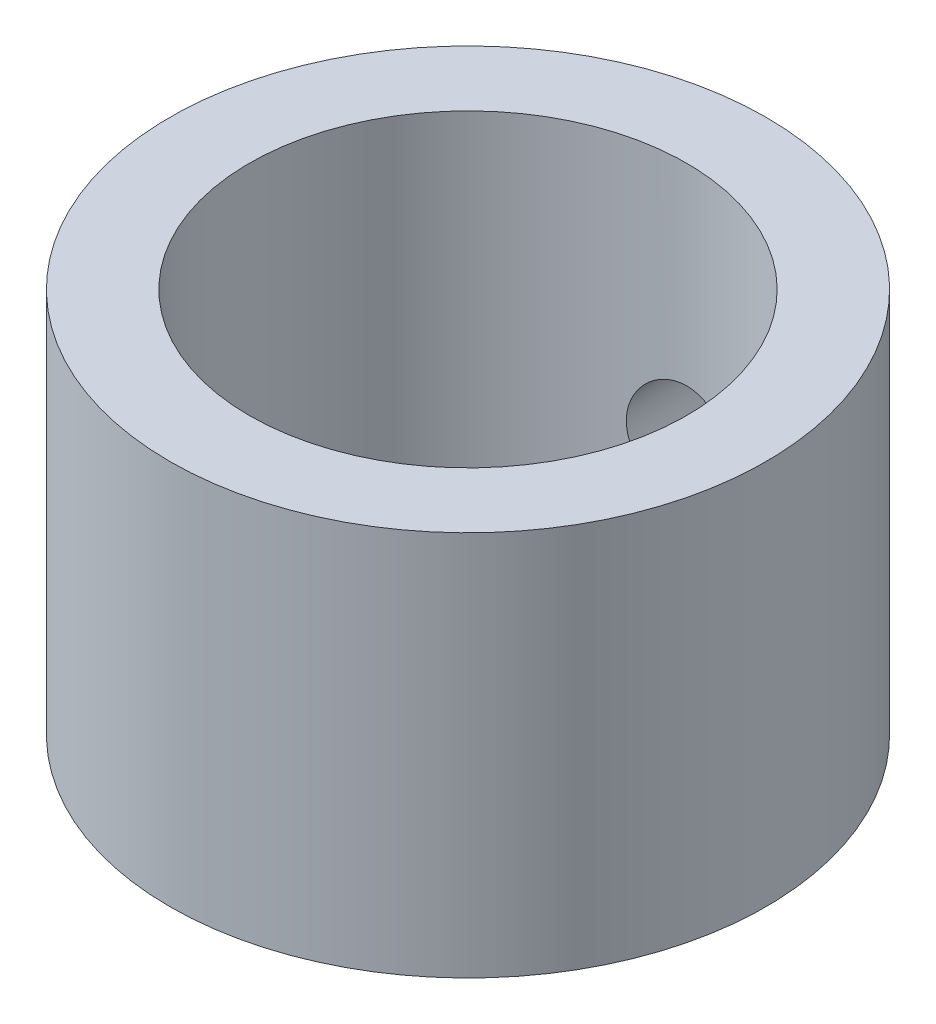
ISO-10303-21;
HEADER;
FILE_DESCRIPTION(('STEP AP214'),'2;1');
FILE_NAME('part.step','',(''),(''),'','','');
FILE_SCHEMA(('AUTOMOTIVE_DESIGN { 1 0 10303 214 1 1 1 1 }'));
ENDSEC;
DATA;
#1=APPLICATION_CONTEXT('core data for automotive mechanical design processes');
#2=APPLICATION_PROTOCOL_DEFINITION('international standard','automotive_design',2000,#1);
#3=PRODUCT_CONTEXT('',#1,'mechanical');
#4=PRODUCT('Part','Part','',(#3));
#5=PRODUCT_RELATED_PRODUCT_CATEGORY('part','',(#4));
#6=PRODUCT_DEFINITION_FORMATION('','',#4);
#7=PRODUCT_DEFINITION_CONTEXT('part definition',#1,'design');
#8=PRODUCT_DEFINITION('design','',#6,#7);
#9=PRODUCT_DEFINITION_SHAPE('','',#8);
#10=(LENGTH_UNIT() NAMED_UNIT(*) SI_UNIT(.MILLI.,.METRE.));
#11=(NAMED_UNIT(*) PLANE_ANGLE_UNIT() SI_UNIT($,.RADIAN.));
#12=(NAMED_UNIT(*) SI_UNIT($,.STERADIAN.) SOLID_ANGLE_UNIT());
#13=UNCERTAINTY_MEASURE_WITH_UNIT(LENGTH_MEASURE(1.E-05),#10,'distance_accuracy_value','');
#14=(GEOMETRIC_REPRESENTATION_CONTEXT(3) GLOBAL_UNCERTAINTY_ASSIGNED_CONTEXT((#13)) GLOBAL_UNIT_ASSIGNED_CONTEXT((#10,
#11,#12)) REPRESENTATION_CONTEXT('',''));
#15=CARTESIAN_POINT('',(0.,0.,0.));
#16=DIRECTION('',(0.,0.,1.));
#17=DIRECTION('',(1.,0.,0.));
#18=AXIS2_PLACEMENT_3D('',#15,#16,#17);
#19=CARTESIAN_POINT('',(0.,0.,0.));
#20=DIRECTION('',(0.,1.,0.));
#21=DIRECTION('',(0.,0.,1.));
#22=AXIS2_PLACEMENT_3D('',#19,#20,#21);
#23=PLANE('',#22);
#24=CARTESIAN_POINT('',(0.,0.,0.));
#25=DIRECTION('',(0.,1.,0.));
#26=DIRECTION('',(0.,0.,1.));
#27=AXIS2_PLACEMENT_3D('',#24,#25,#26);
#28=CIRCLE('',#27,9.525);
#29=CARTESIAN_POINT('',(0.,0.,9.525));
#30=VERTEX_POINT('',#29);
#31=EDGE_CURVE('E10',#30,#30,#28,.T.);
#32=ORIENTED_EDGE('',*,*,#31,.F.);
#33=EDGE_LOOP('',(#32));
#34=FACE_BOUND('',#33,.T.);
#35=CARTESIAN_POINT('',(0.,0.,0.));
#36=DIRECTION('',(0.,1.,0.));
#37=DIRECTION('',(0.,0.,1.));
#38=AXIS2_PLACEMENT_3D('',#35,#36,#37);
#39=CIRCLE('',#38,6.985);
#40=CARTESIAN_POINT('',(0.,0.,6.985));
#41=VERTEX_POINT('',#40);
#42=EDGE_CURVE('E45',#41,#41,#39,.T.);
#43=ORIENTED_EDGE('',*,*,#42,.T.);
#44=EDGE_LOOP('',(#43));
#45=FACE_BOUND('',#44,.T.);
#46=ADVANCED_FACE('F31',(#34,#45),#23,.F.);
#47=CARTESIAN_POINT('',(0.,4.445,0.));
#48=DIRECTION('',(0.,-1.,0.));
#49=DIRECTION('',(0.,0.,-1.));
#50=AXIS2_PLACEMENT_3D('',#47,#48,#49);
#51=CYLINDRICAL_SURFACE('',#50,9.525);
#52=CARTESIAN_POINT('',(0.,6.1595,-9.525));
#53=CARTESIAN_POINT('',(-0.0954775956739414,6.1594962806579,-9.52499829882828));
#54=CARTESIAN_POINT('',(-0.191004397105449,6.15149757329919,-9.52354954239769));
#55=CARTESIAN_POINT('',(-0.37937082774304,6.11973195521184,-9.51790975414186));
#56=CARTESIAN_POINT('',(-0.472208039467171,6.09595129168973,-9.51371633058855));
#57=CARTESIAN_POINT('',(-0.652443448537809,6.03336963114219,-9.50305676664695));
#58=CARTESIAN_POINT('',(-0.739846309455742,5.99458172522165,-9.49659260751604));
#59=CARTESIAN_POINT('',(-0.906894366746162,5.90312273914429,-9.48209926373113));
#60=CARTESIAN_POINT('',(-0.986540286093455,5.85045295452756,-9.47407022513926));
#61=CARTESIAN_POINT('',(-1.13670505743633,5.73210551094706,-9.45723532780296));
#62=CARTESIAN_POINT('',(-1.20712553851598,5.66630400502557,-9.44842255353012));
#63=CARTESIAN_POINT('',(-1.3359899130627,5.52382746948852,-9.43106535815257));
#64=CARTESIAN_POINT('',(-1.39443298649654,5.44715169597391,-9.42252095545581));
#65=CARTESIAN_POINT('',(-1.49808719556154,5.28441515371638,-9.40660083197784));
#66=CARTESIAN_POINT('',(-1.5431992972205,5.19829035610144,-9.39923403605664));
#67=CARTESIAN_POINT('',(-1.61827727569674,5.01952999289207,-9.38660014534282));
#68=CARTESIAN_POINT('',(-1.64824435203196,4.92689494358547,-9.38133288426961));
#69=CARTESIAN_POINT('',(-1.69186804071753,4.73879267575865,-9.37356378709239));
#70=CARTESIAN_POINT('',(-1.70569558394198,4.64336631803518,-9.37103299110417));
#71=CARTESIAN_POINT('',(-1.71717803678369,4.45151700678056,-9.36893595775777));
#72=CARTESIAN_POINT('',(-1.71483428193499,4.35509413620481,-9.36936947558667));
#73=CARTESIAN_POINT('',(-1.69417950443828,4.16522043348779,-9.37312569257245));
#74=CARTESIAN_POINT('',(-1.67606196586981,4.07174775946657,-9.37641338056608));
#75=CARTESIAN_POINT('',(-1.62467822208323,3.88919077231936,-9.38545257746093));
#76=CARTESIAN_POINT('',(-1.59141141912748,3.80010663250348,-9.3912041835793));
#77=CARTESIAN_POINT('',(-1.51048167179206,3.62828448094136,-9.40456021184459));
#78=CARTESIAN_POINT('',(-1.4627397764373,3.54558447453583,-9.41217474978867));
#79=CARTESIAN_POINT('',(-1.35427097721947,3.38929624160546,-9.42839186635934));
#80=CARTESIAN_POINT('',(-1.29354285575569,3.31570887051217,-9.4369945375992));
#81=CARTESIAN_POINT('',(-1.15977815742905,3.17861609368458,-9.45437165554872));
#82=CARTESIAN_POINT('',(-1.08657589217406,3.11527232951862,-9.46314678440982));
#83=CARTESIAN_POINT('',(-0.93049748072582,3.00174083164846,-9.47976521483666));
#84=CARTESIAN_POINT('',(-0.847621251422725,2.95155321098182,-9.48760850839575));
#85=CARTESIAN_POINT('',(-0.674385063879582,2.86573824695064,-9.50149354422627));
#86=CARTESIAN_POINT('',(-0.584017079081404,2.83012676915752,-9.5075333215165));
#87=CARTESIAN_POINT('',(-0.398449230816276,2.77463336892464,-9.51711542565165));
#88=CARTESIAN_POINT('',(-0.303249840771157,2.75474990847581,-9.52065799668932));
#89=CARTESIAN_POINT('',(-0.112113142672695,2.73149975931381,-9.52481325849361));
#90=CARTESIAN_POINT('',(-0.0162036201946852,2.72791144011981,-9.52546526100933));
#91=CARTESIAN_POINT('',(0.174845366618844,2.73676028417332,-9.52387417101183));
#92=CARTESIAN_POINT('',(0.269984865514023,2.74919672415024,-9.52163120916156));
#93=CARTESIAN_POINT('',(0.456097023765723,2.78955775590117,-9.51452663429934));
#94=CARTESIAN_POINT('',(0.547094588542276,2.81737110394692,-9.50968383691693));
#95=CARTESIAN_POINT('',(0.723135169873516,2.88757672049449,-9.49792033518775));
#96=CARTESIAN_POINT('',(0.808177806950631,2.9299699170809,-9.49099949856634));
#97=CARTESIAN_POINT('',(0.970846650701593,3.0286287273959,-9.47574963852673));
#98=CARTESIAN_POINT('',(1.04838873820353,3.08503089410985,-9.46740702377124));
#99=CARTESIAN_POINT('',(1.19298688461317,3.20992068289377,-9.4502761145588));
#100=CARTESIAN_POINT('',(1.26004204524852,3.27840933918059,-9.44148778200857));
#101=CARTESIAN_POINT('',(1.3825974020368,3.42652794430418,-9.42432673932554));
#102=CARTESIAN_POINT('',(1.43794689432651,3.50628344555213,-9.41596039603669));
#103=CARTESIAN_POINT('',(1.53446282082173,3.67409043000645,-9.4007152001884));
#104=CARTESIAN_POINT('',(1.57562975535227,3.76214162042215,-9.39383629515905));
#105=CARTESIAN_POINT('',(1.64239391247,3.94364349912341,-9.38239398741541));
#106=CARTESIAN_POINT('',(1.66806241825689,4.03706726830111,-9.37781999983491));
#107=CARTESIAN_POINT('',(1.70332271108132,4.22699079340818,-9.37148031602969));
#108=CARTESIAN_POINT('',(1.7129161544895,4.32349023137709,-9.36971433047006));
#109=CARTESIAN_POINT('',(1.71570198854979,4.51531810196651,-9.36920446622563));
#110=CARTESIAN_POINT('',(1.7091318945751,4.61064305072087,-9.3704168218808));
#111=CARTESIAN_POINT('',(1.68029476347724,4.79880659042783,-9.37563041346645));
#112=CARTESIAN_POINT('',(1.65802780318876,4.89164519354856,-9.37963163574571));
#113=CARTESIAN_POINT('',(1.59852585238534,5.07208629379416,-9.38995435635258));
#114=CARTESIAN_POINT('',(1.56131462523968,5.15969685136256,-9.39627216961213));
#115=CARTESIAN_POINT('',(1.47300576932761,5.32746962190127,-9.41051915037191));
#116=CARTESIAN_POINT('',(1.42190726688423,5.40763136582551,-9.41844841924418));
#117=CARTESIAN_POINT('',(1.30644039680667,5.55942466043612,-9.43516182934185));
#118=CARTESIAN_POINT('',(1.24189844943796,5.63092305921978,-9.44395626777217));
#119=CARTESIAN_POINT('',(1.10174047350075,5.76215456624066,-9.4613302043816));
#120=CARTESIAN_POINT('',(1.02612190184957,5.8218849652575,-9.46990965266997));
#121=CARTESIAN_POINT('',(0.865216040350084,5.92833922862902,-9.48596914848569));
#122=CARTESIAN_POINT('',(0.779854541031738,5.97495240558168,-9.49343960248897));
#123=CARTESIAN_POINT('',(0.602407818948574,6.05310301062189,-9.50634594449601));
#124=CARTESIAN_POINT('',(0.510329153355661,6.08465492009538,-9.51178378575774));
#125=CARTESIAN_POINT('',(0.34828835417148,6.12521486763602,-9.51887423889086));
#126=CARTESIAN_POINT('',(0.279286485037363,6.13805034301938,-9.52115868816359));
#127=CARTESIAN_POINT('',(0.14019857261476,6.15519418043443,-9.52422217666949));
#128=CARTESIAN_POINT('',(0.0701125533628807,6.15950273124359,-9.52500124923017));
#129=CARTESIAN_POINT('',(0.,6.1595,-9.525));
#130=B_SPLINE_CURVE_WITH_KNOTS('',3,(#52,#53,#54,#55,#56,#57,#58,#59,#60,#61,#62,#63,#64,#65,
#66,#67,#68,#69,#70,#71,#72,#73,#74,#75,#76,#77,#78,#79,#80,#81,#82,#83,#84,#85,#86,#87,#88,#89,
#90,#91,#92,#93,#94,#95,#96,#97,#98,#99,#100,#101,#102,#103,#104,#105,#106,#107,#108,#109,#110,
#111,#112,#113,#114,#115,#116,#117,#118,#119,#120,#121,#122,#123,#124,#125,#126,#127,#128,#129),
.UNSPECIFIED.,.T.,.F.,(4,2,2,2,2,2,2,2,2,2,2,2,2,2,2,2,2,2,2,2,2,2,2,2,2,2,2,2,2,2,2,2,2,2,2,2,
2,2,4),(0.,0.286176428235729,0.572602565842471,0.858779409730447,1.14492955533228,
1.4339181163441,1.72292645635312,2.01403073308406,2.30511195012779,2.59308157333254,
2.88102741436281,3.16549024298598,3.44996429650237,3.73601874448838,4.02210002497644,
4.31232904670582,4.60256056200074,4.8931071484125,5.18362531938362,5.47018007641165,
5.75672190036724,6.04121737086926,6.32573095436787,6.61313487421732,6.90056339858287,
7.19149316419247,7.4824126654792,7.7719837168875,8.06152492912773,8.34683695485375,
8.63214758401395,8.91700631641863,9.20188297402023,9.49069541674885,9.7795742721728,
10.0708222966112,10.3617897196227,10.5719437790965,10.7820931859207),.UNSPECIFIED.);
#131=CARTESIAN_POINT('',(0.,6.1595,-9.525));
#132=VERTEX_POINT('',#131);
#133=EDGE_CURVE('E49',#132,#132,#130,.T.);
#134=ORIENTED_EDGE('',*,*,#133,.T.);
#135=EDGE_LOOP('',(#134));
#136=FACE_BOUND('',#135,.T.);
#137=ORIENTED_EDGE('',*,*,#31,.T.);
#138=EDGE_LOOP('',(#137));
#139=FACE_BOUND('',#138,.T.);
#140=CARTESIAN_POINT('',(0.,12.319,0.));
#141=DIRECTION('',(0.,1.,0.));
#142=DIRECTION('',(0.,0.,1.));
#143=AXIS2_PLACEMENT_3D('',#140,#141,#142);
#144=CIRCLE('',#143,9.525);
#145=CARTESIAN_POINT('',(0.,12.319,9.525));
#146=VERTEX_POINT('',#145);
#147=EDGE_CURVE('E57',#146,#146,#144,.T.);
#148=ORIENTED_EDGE('',*,*,#147,.F.);
#149=EDGE_LOOP('',(#148));
#150=FACE_BOUND('',#149,.T.);
#151=ADVANCED_FACE('F33',(#136,#139,#150),#51,.T.);
#152=CARTESIAN_POINT('',(0.,4.445,0.));
#153=DIRECTION('',(0.,-1.,0.));
#154=DIRECTION('',(0.,0.,-1.));
#155=AXIS2_PLACEMENT_3D('',#152,#153,#154);
#156=CYLINDRICAL_SURFACE('',#155,6.985);
#157=CARTESIAN_POINT('',(0.,6.1595,-6.985));
#158=CARTESIAN_POINT('',(-0.0947829363380953,6.15949724176632,-6.98499836263049));
#159=CARTESIAN_POINT('',(-0.189597041060717,6.15161369407784,-6.98305148403949));
#160=CARTESIAN_POINT('',(-0.376511561673727,6.12033279585042,-6.97547354801783));
#161=CARTESIAN_POINT('',(-0.468610344899103,6.09692630268311,-6.96984031944476));
#162=CARTESIAN_POINT('',(-0.647367704412989,6.03539292997078,-6.95551400257525));
#163=CARTESIAN_POINT('',(-0.734032546421046,5.99728338097808,-6.94682451776216));
#164=CARTESIAN_POINT('',(-0.89973853832688,5.90748577151393,-6.92731300655045));
#165=CARTESIAN_POINT('',(-0.978779498620246,5.85579737345821,-6.91649092713499));
#166=CARTESIAN_POINT('',(-1.12856790208152,5.73922217170904,-6.89364987571335));
#167=CARTESIAN_POINT('',(-1.19914194520945,5.67411606528654,-6.88161297446368));
#168=CARTESIAN_POINT('',(-1.32848662589523,5.53302329323954,-6.85781910299968));
#169=CARTESIAN_POINT('',(-1.38725597682159,5.45703544312309,-6.84606216342222));
#170=CARTESIAN_POINT('',(-1.4921307716221,5.29499966662318,-6.82397927059471));
#171=CARTESIAN_POINT('',(-1.53804368173046,5.20882373778619,-6.8136761134433));
#172=CARTESIAN_POINT('',(-1.61466463396078,5.02968331719291,-6.79592822643882));
#173=CARTESIAN_POINT('',(-1.64537501097537,4.93671987042098,-6.78848305767889));
#174=CARTESIAN_POINT('',(-1.69013040922095,4.74854623415053,-6.77747815370839));
#175=CARTESIAN_POINT('',(-1.70448650047592,4.65341436224764,-6.77384600113822));
#176=CARTESIAN_POINT('',(-1.71709449814169,4.46202847046564,-6.77066150244626));
#177=CARTESIAN_POINT('',(-1.71534892442653,4.36577462852703,-6.77110851794382));
#178=CARTESIAN_POINT('',(-1.69605165744303,4.17724998653565,-6.77596667973727));
#179=CARTESIAN_POINT('',(-1.67886918032305,4.08493863640968,-6.78028522263986));
#180=CARTESIAN_POINT('',(-1.6297742164293,3.90455046782875,-6.79225245055436));
#181=CARTESIAN_POINT('',(-1.59786071405208,3.81647394179831,-6.79990136517055));
#182=CARTESIAN_POINT('',(-1.51989128619374,3.64605825734657,-6.81775344212201));
#183=CARTESIAN_POINT('',(-1.47370015408654,3.56378360507287,-6.8279808438241));
#184=CARTESIAN_POINT('',(-1.36858129510489,3.40802006382925,-6.84982366435824));
#185=CARTESIAN_POINT('',(-1.30965141367856,3.33453266434956,-6.86143931784167));
#186=CARTESIAN_POINT('',(-1.17880892156185,3.19631225220098,-6.88514090637274));
#187=CARTESIAN_POINT('',(-1.10658435836223,3.1318748946795,-6.8972309985619));
#188=CARTESIAN_POINT('',(-0.952210443227801,3.01597176078442,-6.92023128530741));
#189=CARTESIAN_POINT('',(-0.870060809341648,2.96450635304612,-6.93114144632759));
#190=CARTESIAN_POINT('',(-0.697756212649559,2.8759050079316,-6.95060375376447));
#191=CARTESIAN_POINT('',(-0.607576364481539,2.83881566655834,-6.95914820725597));
#192=CARTESIAN_POINT('',(-0.422005731068417,2.78040434847835,-6.97286028809619));
#193=CARTESIAN_POINT('',(-0.326615909152044,2.75907946743675,-6.97802853743292));
#194=CARTESIAN_POINT('',(-0.13586213809632,2.73325062441043,-6.98431437924648));
#195=CARTESIAN_POINT('',(-0.0405558467990412,2.72834385776589,-6.985528951223));
#196=CARTESIAN_POINT('',(0.149515782018332,2.73438773535684,-6.98404612223033));
#197=CARTESIAN_POINT('',(0.244281165653614,2.7453370068809,-6.98134905990466));
#198=CARTESIAN_POINT('',(0.429191171854109,2.78244977019257,-6.97240801618171));
#199=CARTESIAN_POINT('',(0.519382326039186,2.80839480849356,-6.96621499242483));
#200=CARTESIAN_POINT('',(0.694128387227594,2.8745141810626,-6.95097911240672));
#201=CARTESIAN_POINT('',(0.77868273617546,2.91468992172139,-6.94193597448437));
#202=CARTESIAN_POINT('',(0.941367342176005,3.00891979258732,-6.92176951621574));
#203=CARTESIAN_POINT('',(1.01936173136895,3.06320122586287,-6.91061302405453));
#204=CARTESIAN_POINT('',(1.16527787603864,3.1838097868942,-6.88751184095895));
#205=CARTESIAN_POINT('',(1.23319795581821,3.25013891451501,-6.87556701937519));
#206=CARTESIAN_POINT('',(1.35868731974075,3.39482731928169,-6.85188843809822));
#207=CARTESIAN_POINT('',(1.41597454074109,3.47343353613597,-6.84016630971565));
#208=CARTESIAN_POINT('',(1.51654294525215,3.6393826820058,-6.81857598960166));
#209=CARTESIAN_POINT('',(1.55982475434951,3.72672522056356,-6.80870771507149));
#210=CARTESIAN_POINT('',(1.63083421462264,3.90719488172474,-6.79204944340769));
#211=CARTESIAN_POINT('',(1.6586539764399,4.00028399617565,-6.78524126417754));
#212=CARTESIAN_POINT('',(1.69819754218783,4.19000971994108,-6.77545370023637));
#213=CARTESIAN_POINT('',(1.70992471573981,4.28664558225087,-6.77247351399162));
#214=CARTESIAN_POINT('',(1.7167789702964,4.47785569983835,-6.77073888110085));
#215=CARTESIAN_POINT('',(1.71235626476456,4.57241303985072,-6.7718698236718));
#216=CARTESIAN_POINT('',(1.68806303412562,4.75938962170557,-6.77796591784704));
#217=CARTESIAN_POINT('',(1.6681927980965,4.85180890352536,-6.78293099770102));
#218=CARTESIAN_POINT('',(1.61381029972101,5.03141660388505,-6.79607322871844));
#219=CARTESIAN_POINT('',(1.57937959695127,5.11863111760096,-6.80423246935296));
#220=CARTESIAN_POINT('',(1.49691858227731,5.2861066528595,-6.82284680388268));
#221=CARTESIAN_POINT('',(1.44888645224081,5.36636674291478,-6.8333022046686));
#222=CARTESIAN_POINT('',(1.33916213882871,5.51983754308451,-6.85566001158601));
#223=CARTESIAN_POINT('',(1.27715623891991,5.59281965475717,-6.86759224146855));
#224=CARTESIAN_POINT('',(1.14185967994562,5.72748958173058,-6.89137799543751));
#225=CARTESIAN_POINT('',(1.06856635910156,5.78917472547046,-6.90323150026958));
#226=CARTESIAN_POINT('',(0.911246615175867,5.90053674291969,-6.92576854234103));
#227=CARTESIAN_POINT('',(0.827056576469993,5.94998763792667,-6.93642831676742));
#228=CARTESIAN_POINT('',(0.651305741115947,6.03395578036669,-6.9551282879558));
#229=CARTESIAN_POINT('',(0.559750426412226,6.06848401490236,-6.96317041093446));
#230=CARTESIAN_POINT('',(0.390263413438411,6.11634118160939,-6.97450167561535));
#231=CARTESIAN_POINT('',(0.313157554546654,6.13249141048455,-6.97841192404438));
#232=CARTESIAN_POINT('',(0.157374886255175,6.15407159088719,-6.9836616763347));
#233=CARTESIAN_POINT('',(0.0786981868166983,6.15950229015894,-6.98500135950643));
#234=CARTESIAN_POINT('',(0.,6.1595,-6.985));
#235=B_SPLINE_CURVE_WITH_KNOTS('',3,(#157,#158,#159,#160,#161,#162,#163,#164,#165,#166,#167,
#168,#169,#170,#171,#172,#173,#174,#175,#176,#177,#178,#179,#180,#181,#182,#183,#184,#185,#186,
#187,#188,#189,#190,#191,#192,#193,#194,#195,#196,#197,#198,#199,#200,#201,#202,#203,#204,#205,
#206,#207,#208,#209,#210,#211,#212,#213,#214,#215,#216,#217,#218,#219,#220,#221,#222,#223,#224,
#225,#226,#227,#228,#229,#230,#231,#232,#233,#234),.UNSPECIFIED.,.T.,.F.,(4,2,2,2,2,2,2,2,2,2,2,
2,2,2,2,2,2,2,2,2,2,2,2,2,2,2,2,2,2,2,2,2,2,2,2,2,2,2,4),(0.,0.284060461635071,
0.568288376567849,0.852182289406782,1.136083260811,1.42505637291123,1.71406096405343,
2.00718667692174,2.30026735587584,2.58767514275613,2.87503795173322,3.15570546214435,
3.43639232555153,3.7198231894835,4.00330202868712,4.29456179213504,4.5858298316349,
4.87803419452401,5.17018471028204,5.4551128443894,5.74001631276857,6.02087041294431,
6.30175227709491,6.58747610773847,6.87324741071653,7.16576198044228,7.45826348247135,
7.74900328565996,8.03968220165076,8.32232044538577,8.60495340008583,8.88602374596215,
9.16713168087085,9.4553231734002,9.74358273107092,10.0368245699861,10.3298501344775,
10.5657217342398,10.8015768801202),.UNSPECIFIED.);
#236=CARTESIAN_POINT('',(0.,6.1595,-6.985));
#237=VERTEX_POINT('',#236);
#238=EDGE_CURVE('E36',#237,#237,#235,.T.);
#239=ORIENTED_EDGE('',*,*,#238,.F.);
#240=EDGE_LOOP('',(#239));
#241=FACE_BOUND('',#240,.T.);
#242=ORIENTED_EDGE('',*,*,#42,.F.);
#243=EDGE_LOOP('',(#242));
#244=FACE_BOUND('',#243,.T.);
#245=CARTESIAN_POINT('',(0.,12.319,0.));
#246=DIRECTION('',(0.,1.,0.));
#247=DIRECTION('',(0.,0.,1.));
#248=AXIS2_PLACEMENT_3D('',#245,#246,#247);
#249=CIRCLE('',#248,6.985);
#250=CARTESIAN_POINT('',(0.,12.319,6.985));
#251=VERTEX_POINT('',#250);
#252=EDGE_CURVE('E82',#251,#251,#249,.T.);
#253=ORIENTED_EDGE('',*,*,#252,.T.);
#254=EDGE_LOOP('',(#253));
#255=FACE_BOUND('',#254,.T.);
#256=ADVANCED_FACE('F64',(#241,#244,#255),#156,.F.);
#257=CARTESIAN_POINT('',(0.,4.445,-9.525));
#258=DIRECTION('',(0.,0.,1.));
#259=DIRECTION('',(1.,0.,0.));
#260=AXIS2_PLACEMENT_3D('',#257,#258,#259);
#261=CYLINDRICAL_SURFACE('',#260,1.7145);
#262=ORIENTED_EDGE('',*,*,#238,.T.);
#263=EDGE_LOOP('',(#262));
#264=FACE_BOUND('',#263,.T.);
#265=ORIENTED_EDGE('',*,*,#133,.F.);
#266=EDGE_LOOP('',(#265));
#267=FACE_BOUND('',#266,.T.);
#268=ADVANCED_FACE('F59',(#264,#267),#261,.F.);
#269=CARTESIAN_POINT('',(0.,12.319,0.));
#270=DIRECTION('',(0.,1.,0.));
#271=DIRECTION('',(0.,0.,1.));
#272=AXIS2_PLACEMENT_3D('',#269,#270,#271);
#273=PLANE('',#272);
#274=ORIENTED_EDGE('',*,*,#147,.T.);
#275=EDGE_LOOP('',(#274));
#276=FACE_BOUND('',#275,.T.);
#277=ORIENTED_EDGE('',*,*,#252,.F.);
#278=EDGE_LOOP('',(#277));
#279=FACE_BOUND('',#278,.T.);
#280=ADVANCED_FACE('F63',(#276,#279),#273,.T.);
#281=CLOSED_SHELL('',(#46,#151,#256,#268,#280));
#282=MANIFOLD_SOLID_BREP('B2',#281);
#283=ADVANCED_BREP_SHAPE_REPRESENTATION('',(#18,#282),#14);
#284=SHAPE_DEFINITION_REPRESENTATION(#9,#283);
ENDSEC;
END-ISO-10303-21;
